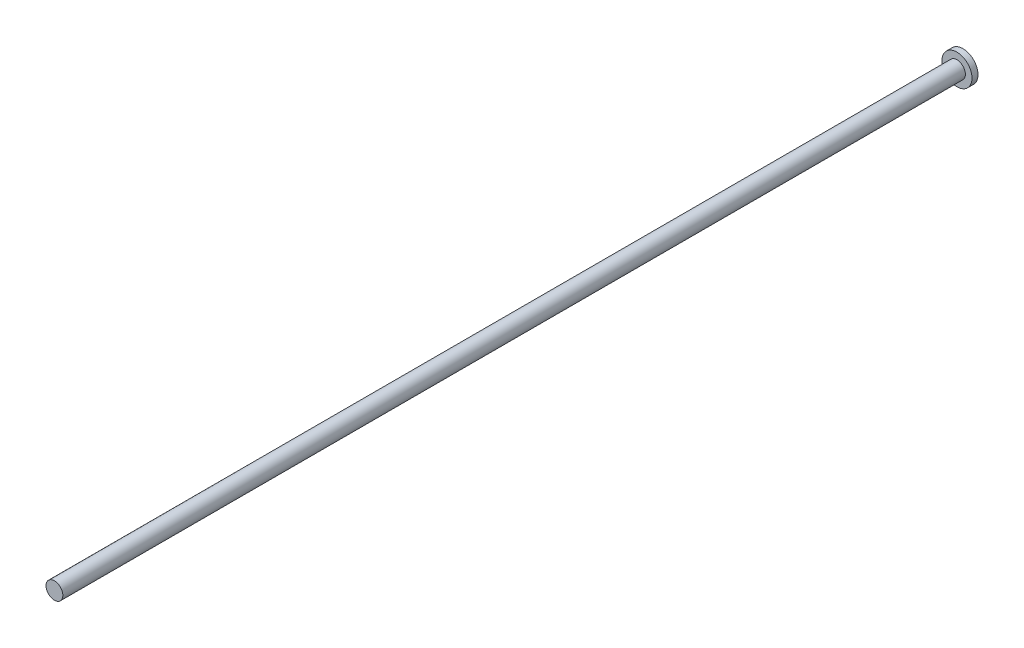
ISO-10303-21;
HEADER;
FILE_DESCRIPTION(('STEP AP214'),'2;1');
FILE_NAME('part.step','',(''),(''),'','','');
FILE_SCHEMA(('AUTOMOTIVE_DESIGN { 1 0 10303 214 1 1 1 1 }'));
ENDSEC;
DATA;
#1=APPLICATION_CONTEXT('core data for automotive mechanical design processes');
#2=APPLICATION_PROTOCOL_DEFINITION('international standard','automotive_design',2000,#1);
#3=PRODUCT_CONTEXT('',#1,'mechanical');
#4=PRODUCT('Part','Part','',(#3));
#5=PRODUCT_RELATED_PRODUCT_CATEGORY('part','',(#4));
#6=PRODUCT_DEFINITION_FORMATION('','',#4);
#7=PRODUCT_DEFINITION_CONTEXT('part definition',#1,'design');
#8=PRODUCT_DEFINITION('design','',#6,#7);
#9=PRODUCT_DEFINITION_SHAPE('','',#8);
#10=(LENGTH_UNIT() NAMED_UNIT(*) SI_UNIT(.MILLI.,.METRE.));
#11=(NAMED_UNIT(*) PLANE_ANGLE_UNIT() SI_UNIT($,.RADIAN.));
#12=(NAMED_UNIT(*) SI_UNIT($,.STERADIAN.) SOLID_ANGLE_UNIT());
#13=UNCERTAINTY_MEASURE_WITH_UNIT(LENGTH_MEASURE(1.E-05),#10,'distance_accuracy_value','');
#14=(GEOMETRIC_REPRESENTATION_CONTEXT(3) GLOBAL_UNCERTAINTY_ASSIGNED_CONTEXT((#13)) GLOBAL_UNIT_ASSIGNED_CONTEXT((#10,
#11,#12)) REPRESENTATION_CONTEXT('',''));
#15=CARTESIAN_POINT('',(0.,0.,0.));
#16=DIRECTION('',(0.,0.,1.));
#17=DIRECTION('',(1.,0.,0.));
#18=AXIS2_PLACEMENT_3D('',#15,#16,#17);
#19=CARTESIAN_POINT('',(0.,0.,1.));
#20=DIRECTION('',(0.,0.,-1.));
#21=DIRECTION('',(-1.,0.,0.));
#22=AXIS2_PLACEMENT_3D('',#19,#20,#21);
#23=CYLINDRICAL_SURFACE('',#22,2.5);
#24=CARTESIAN_POINT('',(0.,0.,1.));
#25=DIRECTION('',(0.,0.,1.));
#26=DIRECTION('',(1.,0.,0.));
#27=AXIS2_PLACEMENT_3D('',#24,#25,#26);
#28=CIRCLE('',#27,2.5);
#29=CARTESIAN_POINT('',(2.5,0.,1.));
#30=VERTEX_POINT('',#29);
#31=EDGE_CURVE('E38',#30,#30,#28,.T.);
#32=ORIENTED_EDGE('',*,*,#31,.F.);
#33=EDGE_LOOP('',(#32));
#34=FACE_BOUND('',#33,.T.);
#35=CARTESIAN_POINT('',(0.,0.,0.));
#36=DIRECTION('',(0.,0.,1.));
#37=DIRECTION('',(1.,0.,0.));
#38=AXIS2_PLACEMENT_3D('',#35,#36,#37);
#39=CIRCLE('',#38,2.5);
#40=CARTESIAN_POINT('',(2.5,0.,0.));
#41=VERTEX_POINT('',#40);
#42=EDGE_CURVE('E34',#41,#41,#39,.T.);
#43=ORIENTED_EDGE('',*,*,#42,.T.);
#44=EDGE_LOOP('',(#43));
#45=FACE_BOUND('',#44,.T.);
#46=ADVANCED_FACE('F31',(#34,#45),#23,.T.);
#47=CARTESIAN_POINT('',(0.,0.,1.));
#48=DIRECTION('',(0.,0.,1.));
#49=DIRECTION('',(1.,0.,0.));
#50=AXIS2_PLACEMENT_3D('',#47,#48,#49);
#51=PLANE('',#50);
#52=CARTESIAN_POINT('',(0.,0.,1.));
#53=DIRECTION('',(0.,0.,1.));
#54=DIRECTION('',(1.,0.,0.));
#55=AXIS2_PLACEMENT_3D('',#52,#53,#54);
#56=CIRCLE('',#55,1.4);
#57=CARTESIAN_POINT('',(1.4,0.,1.));
#58=VERTEX_POINT('',#57);
#59=EDGE_CURVE('E10',#58,#58,#56,.T.);
#60=ORIENTED_EDGE('',*,*,#59,.F.);
#61=EDGE_LOOP('',(#60));
#62=FACE_BOUND('',#61,.T.);
#63=ORIENTED_EDGE('',*,*,#31,.T.);
#64=EDGE_LOOP('',(#63));
#65=FACE_BOUND('',#64,.T.);
#66=ADVANCED_FACE('F55',(#62,#65),#51,.T.);
#67=CARTESIAN_POINT('',(0.,0.,0.));
#68=DIRECTION('',(0.,0.,1.));
#69=DIRECTION('',(1.,0.,0.));
#70=AXIS2_PLACEMENT_3D('',#67,#68,#69);
#71=PLANE('',#70);
#72=ORIENTED_EDGE('',*,*,#42,.F.);
#73=EDGE_LOOP('',(#72));
#74=FACE_BOUND('',#73,.T.);
#75=ADVANCED_FACE('F52',(#74),#71,.F.);
#76=CARTESIAN_POINT('',(0.,0.,151.));
#77=DIRECTION('',(0.,0.,-1.));
#78=DIRECTION('',(-1.,0.,0.));
#79=AXIS2_PLACEMENT_3D('',#76,#77,#78);
#80=CYLINDRICAL_SURFACE('',#79,1.4);
#81=CARTESIAN_POINT('',(0.,0.,151.));
#82=DIRECTION('',(0.,0.,1.));
#83=DIRECTION('',(1.,0.,0.));
#84=AXIS2_PLACEMENT_3D('',#81,#82,#83);
#85=CIRCLE('',#84,1.4);
#86=CARTESIAN_POINT('',(1.4,0.,151.));
#87=VERTEX_POINT('',#86);
#88=EDGE_CURVE('E44',#87,#87,#85,.T.);
#89=ORIENTED_EDGE('',*,*,#88,.F.);
#90=EDGE_LOOP('',(#89));
#91=FACE_BOUND('',#90,.T.);
#92=ORIENTED_EDGE('',*,*,#59,.T.);
#93=EDGE_LOOP('',(#92));
#94=FACE_BOUND('',#93,.T.);
#95=ADVANCED_FACE('F54',(#91,#94),#80,.T.);
#96=CARTESIAN_POINT('',(0.,0.,151.));
#97=DIRECTION('',(0.,0.,1.));
#98=DIRECTION('',(1.,0.,0.));
#99=AXIS2_PLACEMENT_3D('',#96,#97,#98);
#100=PLANE('',#99);
#101=ORIENTED_EDGE('',*,*,#88,.T.);
#102=EDGE_LOOP('',(#101));
#103=FACE_BOUND('',#102,.T.);
#104=ADVANCED_FACE('F60',(#103),#100,.T.);
#105=CLOSED_SHELL('',(#46,#66,#75,#95,#104));
#106=MANIFOLD_SOLID_BREP('B2',#105);
#107=ADVANCED_BREP_SHAPE_REPRESENTATION('',(#18,#106),#14);
#108=SHAPE_DEFINITION_REPRESENTATION(#9,#107);
ENDSEC;
END-ISO-10303-21;
